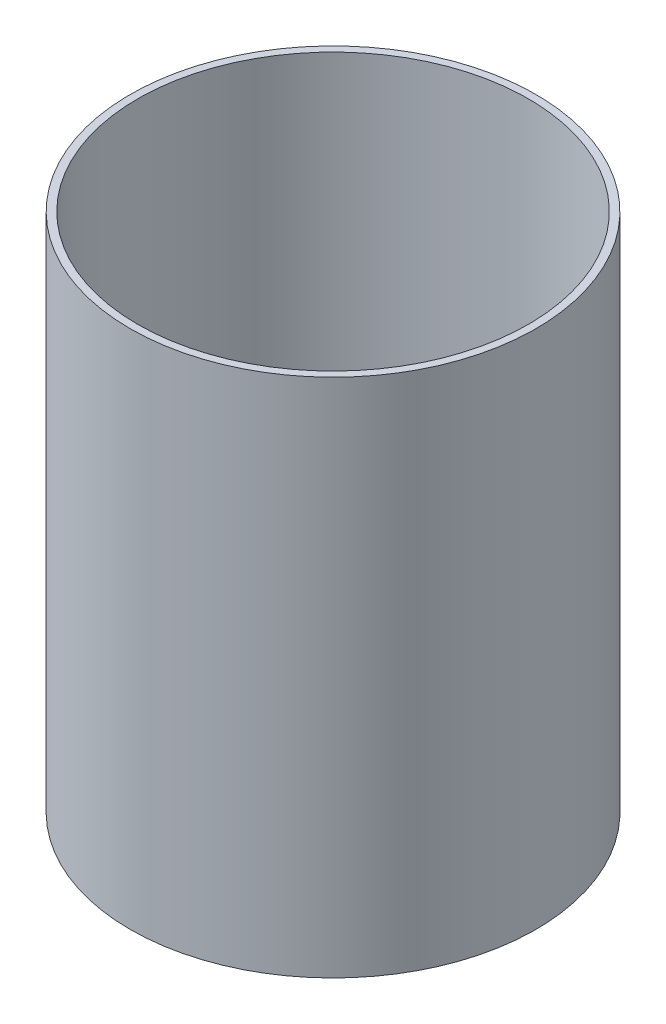
ISO-10303-21;
HEADER;
FILE_DESCRIPTION(('STEP AP214'),'2;1');
FILE_NAME('part.step','',(''),(''),'','','');
FILE_SCHEMA(('AUTOMOTIVE_DESIGN { 1 0 10303 214 1 1 1 1 }'));
ENDSEC;
DATA;
#1=APPLICATION_CONTEXT('core data for automotive mechanical design processes');
#2=APPLICATION_PROTOCOL_DEFINITION('international standard','automotive_design',2000,#1);
#3=PRODUCT_CONTEXT('',#1,'mechanical');
#4=PRODUCT('Part','Part','',(#3));
#5=PRODUCT_RELATED_PRODUCT_CATEGORY('part','',(#4));
#6=PRODUCT_DEFINITION_FORMATION('','',#4);
#7=PRODUCT_DEFINITION_CONTEXT('part definition',#1,'design');
#8=PRODUCT_DEFINITION('design','',#6,#7);
#9=PRODUCT_DEFINITION_SHAPE('','',#8);
#10=(LENGTH_UNIT() NAMED_UNIT(*) SI_UNIT(.MILLI.,.METRE.));
#11=(NAMED_UNIT(*) PLANE_ANGLE_UNIT() SI_UNIT($,.RADIAN.));
#12=(NAMED_UNIT(*) SI_UNIT($,.STERADIAN.) SOLID_ANGLE_UNIT());
#13=UNCERTAINTY_MEASURE_WITH_UNIT(LENGTH_MEASURE(1.E-05),#10,'distance_accuracy_value','');
#14=(GEOMETRIC_REPRESENTATION_CONTEXT(3) GLOBAL_UNCERTAINTY_ASSIGNED_CONTEXT((#13)) GLOBAL_UNIT_ASSIGNED_CONTEXT((#10,
#11,#12)) REPRESENTATION_CONTEXT('',''));
#15=CARTESIAN_POINT('',(0.,0.,0.));
#16=DIRECTION('',(0.,0.,1.));
#17=DIRECTION('',(1.,0.,0.));
#18=AXIS2_PLACEMENT_3D('',#15,#16,#17);
#19=CARTESIAN_POINT('',(0.,127.,0.));
#20=DIRECTION('',(0.,1.,0.));
#21=DIRECTION('',(0.,0.,1.));
#22=AXIS2_PLACEMENT_3D('',#19,#20,#21);
#23=PLANE('',#22);
#24=CARTESIAN_POINT('',(0.,127.,0.));
#25=DIRECTION('',(0.,1.,0.));
#26=DIRECTION('',(0.,0.,1.));
#27=AXIS2_PLACEMENT_3D('',#24,#25,#26);
#28=CIRCLE('',#27,49.5173);
#29=CARTESIAN_POINT('',(0.,127.,49.5173));
#30=VERTEX_POINT('',#29);
#31=EDGE_CURVE('E10',#30,#30,#28,.T.);
#32=ORIENTED_EDGE('',*,*,#31,.T.);
#33=EDGE_LOOP('',(#32));
#34=FACE_BOUND('',#33,.T.);
#35=CARTESIAN_POINT('',(0.,127.,0.));
#36=DIRECTION('',(0.,1.,0.));
#37=DIRECTION('',(0.,0.,1.));
#38=AXIS2_PLACEMENT_3D('',#35,#36,#37);
#39=CIRCLE('',#38,47.6885);
#40=CARTESIAN_POINT('',(0.,127.,47.6885));
#41=VERTEX_POINT('',#40);
#42=EDGE_CURVE('E46',#41,#41,#39,.T.);
#43=ORIENTED_EDGE('',*,*,#42,.F.);
#44=EDGE_LOOP('',(#43));
#45=FACE_BOUND('',#44,.T.);
#46=ADVANCED_FACE('F35',(#34,#45),#23,.T.);
#47=CARTESIAN_POINT('',(0.,0.,0.));
#48=DIRECTION('',(0.,1.,0.));
#49=DIRECTION('',(0.,0.,1.));
#50=AXIS2_PLACEMENT_3D('',#47,#48,#49);
#51=PLANE('',#50);
#52=CARTESIAN_POINT('',(0.,0.,0.));
#53=DIRECTION('',(0.,1.,0.));
#54=DIRECTION('',(0.,0.,1.));
#55=AXIS2_PLACEMENT_3D('',#52,#53,#54);
#56=CIRCLE('',#55,49.5173);
#57=CARTESIAN_POINT('',(0.,0.,49.5173));
#58=VERTEX_POINT('',#57);
#59=EDGE_CURVE('E39',#58,#58,#56,.T.);
#60=ORIENTED_EDGE('',*,*,#59,.F.);
#61=EDGE_LOOP('',(#60));
#62=FACE_BOUND('',#61,.T.);
#63=CARTESIAN_POINT('',(0.,0.,0.));
#64=DIRECTION('',(0.,1.,0.));
#65=DIRECTION('',(0.,0.,1.));
#66=AXIS2_PLACEMENT_3D('',#63,#64,#65);
#67=CIRCLE('',#66,47.6885);
#68=CARTESIAN_POINT('',(0.,0.,47.6885));
#69=VERTEX_POINT('',#68);
#70=EDGE_CURVE('E48',#69,#69,#67,.T.);
#71=ORIENTED_EDGE('',*,*,#70,.T.);
#72=EDGE_LOOP('',(#71));
#73=FACE_BOUND('',#72,.T.);
#74=ADVANCED_FACE('F58',(#62,#73),#51,.F.);
#75=CARTESIAN_POINT('',(0.,127.,0.));
#76=DIRECTION('',(0.,-1.,0.));
#77=DIRECTION('',(0.,0.,-1.));
#78=AXIS2_PLACEMENT_3D('',#75,#76,#77);
#79=CYLINDRICAL_SURFACE('',#78,49.5173);
#80=ORIENTED_EDGE('',*,*,#31,.F.);
#81=EDGE_LOOP('',(#80));
#82=FACE_BOUND('',#81,.T.);
#83=ORIENTED_EDGE('',*,*,#59,.T.);
#84=EDGE_LOOP('',(#83));
#85=FACE_BOUND('',#84,.T.);
#86=ADVANCED_FACE('F37',(#82,#85),#79,.T.);
#87=CARTESIAN_POINT('',(0.,127.,0.));
#88=DIRECTION('',(0.,-1.,0.));
#89=DIRECTION('',(0.,0.,-1.));
#90=AXIS2_PLACEMENT_3D('',#87,#88,#89);
#91=CYLINDRICAL_SURFACE('',#90,47.6885);
#92=ORIENTED_EDGE('',*,*,#42,.T.);
#93=EDGE_LOOP('',(#92));
#94=FACE_BOUND('',#93,.T.);
#95=ORIENTED_EDGE('',*,*,#70,.F.);
#96=EDGE_LOOP('',(#95));
#97=FACE_BOUND('',#96,.T.);
#98=ADVANCED_FACE('F54',(#94,#97),#91,.F.);
#99=CLOSED_SHELL('',(#46,#74,#86,#98));
#100=MANIFOLD_SOLID_BREP('B2',#99);
#101=ADVANCED_BREP_SHAPE_REPRESENTATION('',(#18,#100),#14);
#102=SHAPE_DEFINITION_REPRESENTATION(#9,#101);
ENDSEC;
END-ISO-10303-21;
